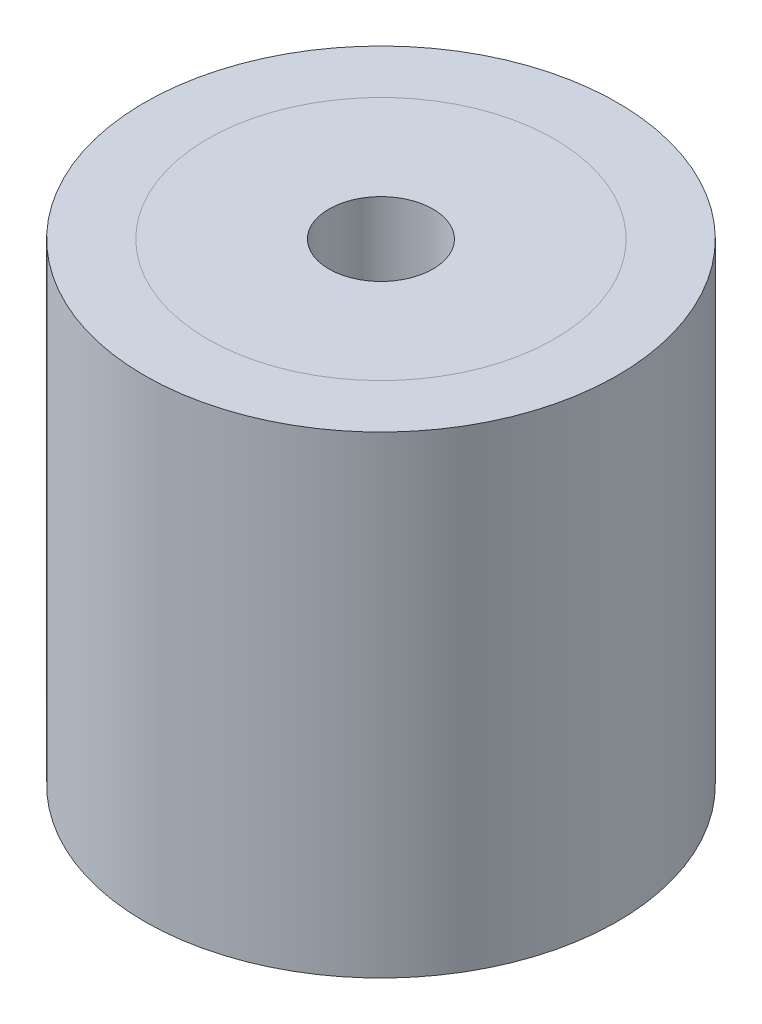
ISO-10303-21;
HEADER;
FILE_DESCRIPTION(('STEP AP214'),'2;1');
FILE_NAME('part.step','',(''),(''),'','','');
FILE_SCHEMA(('AUTOMOTIVE_DESIGN { 1 0 10303 214 1 1 1 1 }'));
ENDSEC;
DATA;
#1=APPLICATION_CONTEXT('core data for automotive mechanical design processes');
#2=APPLICATION_PROTOCOL_DEFINITION('international standard','automotive_design',2000,#1);
#3=PRODUCT_CONTEXT('',#1,'mechanical');
#4=PRODUCT('Part','Part','',(#3));
#5=PRODUCT_RELATED_PRODUCT_CATEGORY('part','',(#4));
#6=PRODUCT_DEFINITION_FORMATION('','',#4);
#7=PRODUCT_DEFINITION_CONTEXT('part definition',#1,'design');
#8=PRODUCT_DEFINITION('design','',#6,#7);
#9=PRODUCT_DEFINITION_SHAPE('','',#8);
#10=(LENGTH_UNIT() NAMED_UNIT(*) SI_UNIT(.MILLI.,.METRE.));
#11=(NAMED_UNIT(*) PLANE_ANGLE_UNIT() SI_UNIT($,.RADIAN.));
#12=(NAMED_UNIT(*) SI_UNIT($,.STERADIAN.) SOLID_ANGLE_UNIT());
#13=UNCERTAINTY_MEASURE_WITH_UNIT(LENGTH_MEASURE(1.E-05),#10,'distance_accuracy_value','');
#14=(GEOMETRIC_REPRESENTATION_CONTEXT(3) GLOBAL_UNCERTAINTY_ASSIGNED_CONTEXT((#13)) GLOBAL_UNIT_ASSIGNED_CONTEXT((#10,
#11,#12)) REPRESENTATION_CONTEXT('',''));
#15=CARTESIAN_POINT('',(0.,0.,0.));
#16=DIRECTION('',(0.,0.,1.));
#17=DIRECTION('',(1.,0.,0.));
#18=AXIS2_PLACEMENT_3D('',#15,#16,#17);
#19=CARTESIAN_POINT('',(0.,-7.5,0.));
#20=DIRECTION('',(0.,1.,0.));
#21=DIRECTION('',(0.,0.,1.));
#22=AXIS2_PLACEMENT_3D('',#19,#20,#21);
#23=PLANE('',#22);
#24=CARTESIAN_POINT('',(0.,-7.5,0.));
#25=DIRECTION('',(0.,1.,0.));
#26=DIRECTION('',(0.,0.,1.));
#27=AXIS2_PLACEMENT_3D('',#24,#25,#26);
#28=CIRCLE('',#27,7.5);
#29=CARTESIAN_POINT('',(0.,-7.5,7.5));
#30=VERTEX_POINT('',#29);
#31=EDGE_CURVE('E60',#30,#30,#28,.T.);
#32=ORIENTED_EDGE('',*,*,#31,.F.);
#33=EDGE_LOOP('',(#32));
#34=FACE_BOUND('',#33,.T.);
#35=CARTESIAN_POINT('',(0.,-7.5,0.));
#36=DIRECTION('',(0.,1.,0.));
#37=DIRECTION('',(0.,0.,1.));
#38=AXIS2_PLACEMENT_3D('',#35,#36,#37);
#39=CIRCLE('',#38,5.5);
#40=CARTESIAN_POINT('',(0.,-7.5,5.5));
#41=VERTEX_POINT('',#40);
#42=EDGE_CURVE('E10',#41,#41,#39,.F.);
#43=ORIENTED_EDGE('',*,*,#42,.F.);
#44=EDGE_LOOP('',(#43));
#45=FACE_BOUND('',#44,.T.);
#46=ADVANCED_FACE('F40',(#34,#45),#23,.F.);
#47=CARTESIAN_POINT('',(0.,7.5,0.));
#48=DIRECTION('',(0.,1.,0.));
#49=DIRECTION('',(0.,0.,1.));
#50=AXIS2_PLACEMENT_3D('',#47,#48,#49);
#51=PLANE('',#50);
#52=CARTESIAN_POINT('',(0.,7.5,0.));
#53=DIRECTION('',(0.,1.,0.));
#54=DIRECTION('',(0.,0.,1.));
#55=AXIS2_PLACEMENT_3D('',#52,#53,#54);
#56=CIRCLE('',#55,7.5);
#57=CARTESIAN_POINT('',(0.,7.5,7.5));
#58=VERTEX_POINT('',#57);
#59=EDGE_CURVE('E55',#58,#58,#56,.T.);
#60=ORIENTED_EDGE('',*,*,#59,.T.);
#61=EDGE_LOOP('',(#60));
#62=FACE_BOUND('',#61,.T.);
#63=CARTESIAN_POINT('',(0.,7.5,0.));
#64=DIRECTION('',(0.,1.,0.));
#65=DIRECTION('',(0.,0.,1.));
#66=AXIS2_PLACEMENT_3D('',#63,#64,#65);
#67=CIRCLE('',#66,5.5);
#68=CARTESIAN_POINT('',(0.,7.5,5.5));
#69=VERTEX_POINT('',#68);
#70=EDGE_CURVE('E44',#69,#69,#67,.F.);
#71=ORIENTED_EDGE('',*,*,#70,.T.);
#72=EDGE_LOOP('',(#71));
#73=FACE_BOUND('',#72,.T.);
#74=ADVANCED_FACE('F77',(#62,#73),#51,.T.);
#75=CARTESIAN_POINT('',(0.,7.5,0.));
#76=DIRECTION('',(0.,-1.,0.));
#77=DIRECTION('',(0.,0.,-1.));
#78=AXIS2_PLACEMENT_3D('',#75,#76,#77);
#79=CYLINDRICAL_SURFACE('',#78,7.5);
#80=ORIENTED_EDGE('',*,*,#59,.F.);
#81=EDGE_LOOP('',(#80));
#82=FACE_BOUND('',#81,.T.);
#83=ORIENTED_EDGE('',*,*,#31,.T.);
#84=EDGE_LOOP('',(#83));
#85=FACE_BOUND('',#84,.T.);
#86=ADVANCED_FACE('F42',(#82,#85),#79,.T.);
#87=ORIENTED_EDGE('',*,*,#70,.F.);
#88=EDGE_LOOP('',(#87));
#89=FACE_BOUND('',#88,.T.);
#90=CARTESIAN_POINT('',(0.,7.5,0.));
#91=DIRECTION('',(0.,1.,0.));
#92=DIRECTION('',(0.,0.,1.));
#93=AXIS2_PLACEMENT_3D('',#90,#91,#92);
#94=CIRCLE('',#93,1.64999999999999);
#95=CARTESIAN_POINT('',(0.,7.5,1.64999999999999));
#96=VERTEX_POINT('',#95);
#97=EDGE_CURVE('E61',#96,#96,#94,.T.);
#98=ORIENTED_EDGE('',*,*,#97,.F.);
#99=EDGE_LOOP('',(#98));
#100=FACE_BOUND('',#99,.T.);
#101=ADVANCED_FACE('F72',(#89,#100),#51,.T.);
#102=ORIENTED_EDGE('',*,*,#42,.T.);
#103=EDGE_LOOP('',(#102));
#104=FACE_BOUND('',#103,.T.);
#105=CARTESIAN_POINT('',(0.,-7.5,0.));
#106=DIRECTION('',(0.,1.,0.));
#107=DIRECTION('',(0.,0.,1.));
#108=AXIS2_PLACEMENT_3D('',#105,#106,#107);
#109=CIRCLE('',#108,1.64999999999999);
#110=CARTESIAN_POINT('',(0.,-7.5,1.64999999999999));
#111=VERTEX_POINT('',#110);
#112=EDGE_CURVE('E57',#111,#111,#109,.T.);
#113=ORIENTED_EDGE('',*,*,#112,.T.);
#114=EDGE_LOOP('',(#113));
#115=FACE_BOUND('',#114,.T.);
#116=ADVANCED_FACE('F74',(#104,#115),#23,.F.);
#117=CARTESIAN_POINT('',(0.,7.5,0.));
#118=DIRECTION('',(0.,1.,0.));
#119=DIRECTION('',(0.,0.,1.));
#120=AXIS2_PLACEMENT_3D('',#117,#118,#119);
#121=CYLINDRICAL_SURFACE('',#120,1.64999999999999);
#122=ORIENTED_EDGE('',*,*,#97,.T.);
#123=EDGE_LOOP('',(#122));
#124=FACE_BOUND('',#123,.T.);
#125=ORIENTED_EDGE('',*,*,#112,.F.);
#126=EDGE_LOOP('',(#125));
#127=FACE_BOUND('',#126,.T.);
#128=ADVANCED_FACE('F69',(#124,#127),#121,.F.);
#129=CLOSED_SHELL('',(#46,#74,#86,#101,#116,#128));
#130=MANIFOLD_SOLID_BREP('B2',#129);
#131=ADVANCED_BREP_SHAPE_REPRESENTATION('',(#18,#130),#14);
#132=SHAPE_DEFINITION_REPRESENTATION(#9,#131);
ENDSEC;
END-ISO-10303-21;
